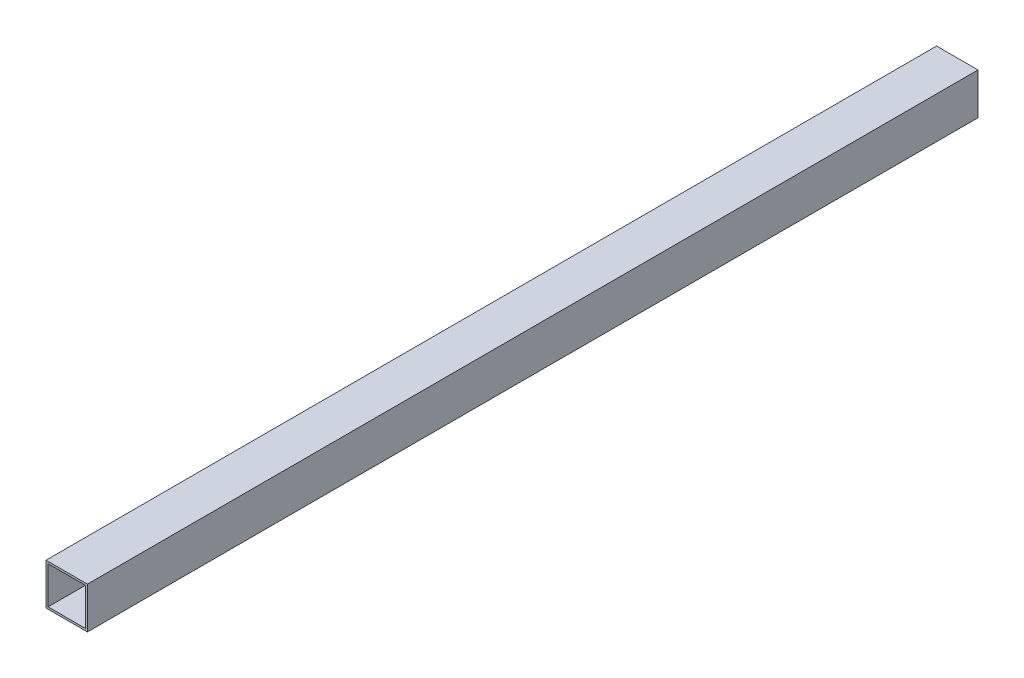
ISO-10303-21;
HEADER;
FILE_DESCRIPTION(('STEP AP214'),'2;1');
FILE_NAME('part.step','',(''),(''),'','','');
FILE_SCHEMA(('AUTOMOTIVE_DESIGN { 1 0 10303 214 1 1 1 1 }'));
ENDSEC;
DATA;
#1=APPLICATION_CONTEXT('core data for automotive mechanical design processes');
#2=APPLICATION_PROTOCOL_DEFINITION('international standard','automotive_design',2000,#1);
#3=PRODUCT_CONTEXT('',#1,'mechanical');
#4=PRODUCT('Part','Part','',(#3));
#5=PRODUCT_RELATED_PRODUCT_CATEGORY('part','',(#4));
#6=PRODUCT_DEFINITION_FORMATION('','',#4);
#7=PRODUCT_DEFINITION_CONTEXT('part definition',#1,'design');
#8=PRODUCT_DEFINITION('design','',#6,#7);
#9=PRODUCT_DEFINITION_SHAPE('','',#8);
#10=(LENGTH_UNIT() NAMED_UNIT(*) SI_UNIT(.MILLI.,.METRE.));
#11=(NAMED_UNIT(*) PLANE_ANGLE_UNIT() SI_UNIT($,.RADIAN.));
#12=(NAMED_UNIT(*) SI_UNIT($,.STERADIAN.) SOLID_ANGLE_UNIT());
#13=UNCERTAINTY_MEASURE_WITH_UNIT(LENGTH_MEASURE(1.E-05),#10,'distance_accuracy_value','');
#14=(GEOMETRIC_REPRESENTATION_CONTEXT(3) GLOBAL_UNCERTAINTY_ASSIGNED_CONTEXT((#13)) GLOBAL_UNIT_ASSIGNED_CONTEXT((#10,
#11,#12)) REPRESENTATION_CONTEXT('',''));
#15=CARTESIAN_POINT('',(0.,0.,0.));
#16=DIRECTION('',(0.,0.,1.));
#17=DIRECTION('',(1.,0.,0.));
#18=AXIS2_PLACEMENT_3D('',#15,#16,#17);
#19=CARTESIAN_POINT('',(0.,0.,430.));
#20=DIRECTION('',(0.,0.,1.));
#21=DIRECTION('',(1.,0.,0.));
#22=AXIS2_PLACEMENT_3D('',#19,#20,#21);
#23=PLANE('',#22);
#24=DIRECTION('',(0.,-1.,0.));
#25=VECTOR('',#24,1.);
#26=CARTESIAN_POINT('',(0.,0.,430.));
#27=LINE('',#26,#25);
#28=CARTESIAN_POINT('',(0.,0.,430.));
#29=VERTEX_POINT('',#28);
#30=CARTESIAN_POINT('',(0.,-20.,430.));
#31=VERTEX_POINT('',#30);
#32=EDGE_CURVE('E134',#29,#31,#27,.T.);
#33=ORIENTED_EDGE('',*,*,#32,.T.);
#34=DIRECTION('',(1.,0.,0.));
#35=VECTOR('',#34,1.);
#36=CARTESIAN_POINT('',(0.,-20.,430.));
#37=LINE('',#36,#35);
#38=CARTESIAN_POINT('',(20.,-20.,430.));
#39=VERTEX_POINT('',#38);
#40=EDGE_CURVE('E137',#31,#39,#37,.T.);
#41=ORIENTED_EDGE('',*,*,#40,.T.);
#42=DIRECTION('',(0.,1.,0.));
#43=VECTOR('',#42,1.);
#44=CARTESIAN_POINT('',(20.,0.,430.));
#45=LINE('',#44,#43);
#46=CARTESIAN_POINT('',(20.,0.,430.));
#47=VERTEX_POINT('',#46);
#48=EDGE_CURVE('E140',#39,#47,#45,.T.);
#49=ORIENTED_EDGE('',*,*,#48,.T.);
#50=DIRECTION('',(-1.,0.,0.));
#51=VECTOR('',#50,1.);
#52=CARTESIAN_POINT('',(0.,0.,430.));
#53=LINE('',#52,#51);
#54=EDGE_CURVE('E142',#47,#29,#53,.T.);
#55=ORIENTED_EDGE('',*,*,#54,.T.);
#56=EDGE_LOOP('',(#33,#41,#49,#55));
#57=FACE_BOUND('',#56,.T.);
#58=DIRECTION('',(-1.,0.,0.));
#59=VECTOR('',#58,1.);
#60=CARTESIAN_POINT('',(1.,-1.,430.));
#61=LINE('',#60,#59);
#62=CARTESIAN_POINT('',(19.,-1.,430.));
#63=VERTEX_POINT('',#62);
#64=CARTESIAN_POINT('',(1.,-1.,430.));
#65=VERTEX_POINT('',#64);
#66=EDGE_CURVE('E106',#63,#65,#61,.T.);
#67=ORIENTED_EDGE('',*,*,#66,.F.);
#68=DIRECTION('',(0.,1.,0.));
#69=VECTOR('',#68,1.);
#70=CARTESIAN_POINT('',(19.,-19.,430.));
#71=LINE('',#70,#69);
#72=CARTESIAN_POINT('',(19.,-19.,430.));
#73=VERTEX_POINT('',#72);
#74=EDGE_CURVE('E98',#73,#63,#71,.T.);
#75=ORIENTED_EDGE('',*,*,#74,.F.);
#76=DIRECTION('',(1.,0.,0.));
#77=VECTOR('',#76,1.);
#78=CARTESIAN_POINT('',(1.,-19.,430.));
#79=LINE('',#78,#77);
#80=CARTESIAN_POINT('',(1.,-19.,430.));
#81=VERTEX_POINT('',#80);
#82=EDGE_CURVE('E120',#81,#73,#79,.T.);
#83=ORIENTED_EDGE('',*,*,#82,.F.);
#84=DIRECTION('',(0.,-1.,0.));
#85=VECTOR('',#84,1.);
#86=CARTESIAN_POINT('',(1.,-19.,430.));
#87=LINE('',#86,#85);
#88=EDGE_CURVE('E118',#65,#81,#87,.T.);
#89=ORIENTED_EDGE('',*,*,#88,.F.);
#90=EDGE_LOOP('',(#67,#75,#83,#89));
#91=FACE_BOUND('',#90,.T.);
#92=ADVANCED_FACE('F33',(#57,#91),#23,.T.);
#93=CARTESIAN_POINT('',(0.,0.,0.));
#94=DIRECTION('',(0.,0.,1.));
#95=DIRECTION('',(1.,0.,0.));
#96=AXIS2_PLACEMENT_3D('',#93,#94,#95);
#97=PLANE('',#96);
#98=DIRECTION('',(0.,-1.,0.));
#99=VECTOR('',#98,1.);
#100=CARTESIAN_POINT('',(0.,0.,0.));
#101=LINE('',#100,#99);
#102=CARTESIAN_POINT('',(0.,0.,0.));
#103=VERTEX_POINT('',#102);
#104=CARTESIAN_POINT('',(0.,-20.,0.));
#105=VERTEX_POINT('',#104);
#106=EDGE_CURVE('E114',#103,#105,#101,.T.);
#107=ORIENTED_EDGE('',*,*,#106,.F.);
#108=DIRECTION('',(-1.,0.,0.));
#109=VECTOR('',#108,1.);
#110=CARTESIAN_POINT('',(0.,0.,0.));
#111=LINE('',#110,#109);
#112=CARTESIAN_POINT('',(20.,0.,0.));
#113=VERTEX_POINT('',#112);
#114=EDGE_CURVE('E138',#113,#103,#111,.T.);
#115=ORIENTED_EDGE('',*,*,#114,.F.);
#116=DIRECTION('',(0.,1.,0.));
#117=VECTOR('',#116,1.);
#118=CARTESIAN_POINT('',(20.,0.,0.));
#119=LINE('',#118,#117);
#120=CARTESIAN_POINT('',(20.,-20.,0.));
#121=VERTEX_POINT('',#120);
#122=EDGE_CURVE('E149',#121,#113,#119,.T.);
#123=ORIENTED_EDGE('',*,*,#122,.F.);
#124=DIRECTION('',(1.,0.,0.));
#125=VECTOR('',#124,1.);
#126=CARTESIAN_POINT('',(0.,-20.,0.));
#127=LINE('',#126,#125);
#128=EDGE_CURVE('E147',#105,#121,#127,.T.);
#129=ORIENTED_EDGE('',*,*,#128,.F.);
#130=EDGE_LOOP('',(#107,#115,#123,#129));
#131=FACE_BOUND('',#130,.T.);
#132=DIRECTION('',(0.,1.,0.));
#133=VECTOR('',#132,1.);
#134=CARTESIAN_POINT('',(19.,-19.,0.));
#135=LINE('',#134,#133);
#136=CARTESIAN_POINT('',(19.,-19.,0.));
#137=VERTEX_POINT('',#136);
#138=CARTESIAN_POINT('',(19.,-1.,0.));
#139=VERTEX_POINT('',#138);
#140=EDGE_CURVE('E56',#137,#139,#135,.T.);
#141=ORIENTED_EDGE('',*,*,#140,.T.);
#142=DIRECTION('',(-1.,0.,0.));
#143=VECTOR('',#142,1.);
#144=CARTESIAN_POINT('',(1.,-1.,0.));
#145=LINE('',#144,#143);
#146=CARTESIAN_POINT('',(1.,-1.,0.));
#147=VERTEX_POINT('',#146);
#148=EDGE_CURVE('E113',#139,#147,#145,.T.);
#149=ORIENTED_EDGE('',*,*,#148,.T.);
#150=DIRECTION('',(0.,-1.,0.));
#151=VECTOR('',#150,1.);
#152=CARTESIAN_POINT('',(1.,-19.,0.));
#153=LINE('',#152,#151);
#154=CARTESIAN_POINT('',(1.,-19.,0.));
#155=VERTEX_POINT('',#154);
#156=EDGE_CURVE('E126',#147,#155,#153,.T.);
#157=ORIENTED_EDGE('',*,*,#156,.T.);
#158=DIRECTION('',(1.,0.,0.));
#159=VECTOR('',#158,1.);
#160=CARTESIAN_POINT('',(1.,-19.,0.));
#161=LINE('',#160,#159);
#162=EDGE_CURVE('E107',#155,#137,#161,.T.);
#163=ORIENTED_EDGE('',*,*,#162,.T.);
#164=EDGE_LOOP('',(#141,#149,#157,#163));
#165=FACE_BOUND('',#164,.T.);
#166=ADVANCED_FACE('F167',(#131,#165),#97,.F.);
#167=CARTESIAN_POINT('',(0.,0.,430.));
#168=DIRECTION('',(1.,0.,0.));
#169=DIRECTION('',(0.,0.,-1.));
#170=AXIS2_PLACEMENT_3D('',#167,#168,#169);
#171=PLANE('',#170);
#172=ORIENTED_EDGE('',*,*,#106,.T.);
#173=DIRECTION('',(0.,0.,-1.));
#174=VECTOR('',#173,1.);
#175=CARTESIAN_POINT('',(0.,-20.,430.));
#176=LINE('',#175,#174);
#177=EDGE_CURVE('E11',#31,#105,#176,.T.);
#178=ORIENTED_EDGE('',*,*,#177,.F.);
#179=ORIENTED_EDGE('',*,*,#32,.F.);
#180=DIRECTION('',(0.,0.,-1.));
#181=VECTOR('',#180,1.);
#182=CARTESIAN_POINT('',(0.,0.,430.));
#183=LINE('',#182,#181);
#184=EDGE_CURVE('E144',#29,#103,#183,.T.);
#185=ORIENTED_EDGE('',*,*,#184,.T.);
#186=EDGE_LOOP('',(#172,#178,#179,#185));
#187=FACE_BOUND('',#186,.T.);
#188=ADVANCED_FACE('F35',(#187),#171,.F.);
#189=CARTESIAN_POINT('',(0.,-20.,430.));
#190=DIRECTION('',(0.,1.,0.));
#191=DIRECTION('',(0.,0.,1.));
#192=AXIS2_PLACEMENT_3D('',#189,#190,#191);
#193=PLANE('',#192);
#194=ORIENTED_EDGE('',*,*,#128,.T.);
#195=DIRECTION('',(0.,0.,-1.));
#196=VECTOR('',#195,1.);
#197=CARTESIAN_POINT('',(20.,-20.,430.));
#198=LINE('',#197,#196);
#199=EDGE_CURVE('E41',#39,#121,#198,.T.);
#200=ORIENTED_EDGE('',*,*,#199,.F.);
#201=ORIENTED_EDGE('',*,*,#40,.F.);
#202=ORIENTED_EDGE('',*,*,#177,.T.);
#203=EDGE_LOOP('',(#194,#200,#201,#202));
#204=FACE_BOUND('',#203,.T.);
#205=ADVANCED_FACE('F177',(#204),#193,.F.);
#206=CARTESIAN_POINT('',(20.,0.,430.));
#207=DIRECTION('',(-1.,0.,0.));
#208=DIRECTION('',(0.,-1.,0.));
#209=AXIS2_PLACEMENT_3D('',#206,#207,#208);
#210=PLANE('',#209);
#211=ORIENTED_EDGE('',*,*,#122,.T.);
#212=DIRECTION('',(0.,0.,-1.));
#213=VECTOR('',#212,1.);
#214=CARTESIAN_POINT('',(20.,0.,430.));
#215=LINE('',#214,#213);
#216=EDGE_CURVE('E154',#47,#113,#215,.T.);
#217=ORIENTED_EDGE('',*,*,#216,.F.);
#218=ORIENTED_EDGE('',*,*,#48,.F.);
#219=ORIENTED_EDGE('',*,*,#199,.T.);
#220=EDGE_LOOP('',(#211,#217,#218,#219));
#221=FACE_BOUND('',#220,.T.);
#222=ADVANCED_FACE('F161',(#221),#210,.F.);
#223=CARTESIAN_POINT('',(0.,0.,430.));
#224=DIRECTION('',(0.,-1.,0.));
#225=DIRECTION('',(0.,0.,-1.));
#226=AXIS2_PLACEMENT_3D('',#223,#224,#225);
#227=PLANE('',#226);
#228=ORIENTED_EDGE('',*,*,#114,.T.);
#229=ORIENTED_EDGE('',*,*,#184,.F.);
#230=ORIENTED_EDGE('',*,*,#54,.F.);
#231=ORIENTED_EDGE('',*,*,#216,.T.);
#232=EDGE_LOOP('',(#228,#229,#230,#231));
#233=FACE_BOUND('',#232,.T.);
#234=ADVANCED_FACE('F171',(#233),#227,.F.);
#235=CARTESIAN_POINT('',(19.,-19.,430.));
#236=DIRECTION('',(-1.,0.,0.));
#237=DIRECTION('',(0.,0.,1.));
#238=AXIS2_PLACEMENT_3D('',#235,#236,#237);
#239=PLANE('',#238);
#240=ORIENTED_EDGE('',*,*,#140,.F.);
#241=DIRECTION('',(0.,0.,-1.));
#242=VECTOR('',#241,1.);
#243=CARTESIAN_POINT('',(19.,-19.,430.));
#244=LINE('',#243,#242);
#245=EDGE_CURVE('E102',#73,#137,#244,.T.);
#246=ORIENTED_EDGE('',*,*,#245,.F.);
#247=ORIENTED_EDGE('',*,*,#74,.T.);
#248=DIRECTION('',(0.,0.,-1.));
#249=VECTOR('',#248,1.);
#250=CARTESIAN_POINT('',(19.,-1.,430.));
#251=LINE('',#250,#249);
#252=EDGE_CURVE('E101',#63,#139,#251,.T.);
#253=ORIENTED_EDGE('',*,*,#252,.T.);
#254=EDGE_LOOP('',(#240,#246,#247,#253));
#255=FACE_BOUND('',#254,.T.);
#256=ADVANCED_FACE('F100',(#255),#239,.T.);
#257=CARTESIAN_POINT('',(1.,-1.,430.));
#258=DIRECTION('',(0.,-1.,0.));
#259=DIRECTION('',(0.,0.,-1.));
#260=AXIS2_PLACEMENT_3D('',#257,#258,#259);
#261=PLANE('',#260);
#262=ORIENTED_EDGE('',*,*,#148,.F.);
#263=ORIENTED_EDGE('',*,*,#252,.F.);
#264=ORIENTED_EDGE('',*,*,#66,.T.);
#265=DIRECTION('',(0.,0.,-1.));
#266=VECTOR('',#265,1.);
#267=CARTESIAN_POINT('',(1.,-1.,430.));
#268=LINE('',#267,#266);
#269=EDGE_CURVE('E115',#65,#147,#268,.T.);
#270=ORIENTED_EDGE('',*,*,#269,.T.);
#271=EDGE_LOOP('',(#262,#263,#264,#270));
#272=FACE_BOUND('',#271,.T.);
#273=ADVANCED_FACE('F110',(#272),#261,.T.);
#274=CARTESIAN_POINT('',(1.,-19.,430.));
#275=DIRECTION('',(1.,0.,0.));
#276=DIRECTION('',(0.,0.,-1.));
#277=AXIS2_PLACEMENT_3D('',#274,#275,#276);
#278=PLANE('',#277);
#279=ORIENTED_EDGE('',*,*,#156,.F.);
#280=ORIENTED_EDGE('',*,*,#269,.F.);
#281=ORIENTED_EDGE('',*,*,#88,.T.);
#282=DIRECTION('',(0.,0.,-1.));
#283=VECTOR('',#282,1.);
#284=CARTESIAN_POINT('',(1.,-19.,430.));
#285=LINE('',#284,#283);
#286=EDGE_CURVE('E48',#81,#155,#285,.T.);
#287=ORIENTED_EDGE('',*,*,#286,.T.);
#288=EDGE_LOOP('',(#279,#280,#281,#287));
#289=FACE_BOUND('',#288,.T.);
#290=ADVANCED_FACE('F200',(#289),#278,.T.);
#291=CARTESIAN_POINT('',(1.,-19.,430.));
#292=DIRECTION('',(0.,1.,0.));
#293=DIRECTION('',(0.,0.,1.));
#294=AXIS2_PLACEMENT_3D('',#291,#292,#293);
#295=PLANE('',#294);
#296=ORIENTED_EDGE('',*,*,#162,.F.);
#297=ORIENTED_EDGE('',*,*,#286,.F.);
#298=ORIENTED_EDGE('',*,*,#82,.T.);
#299=ORIENTED_EDGE('',*,*,#245,.T.);
#300=EDGE_LOOP('',(#296,#297,#298,#299));
#301=FACE_BOUND('',#300,.T.);
#302=ADVANCED_FACE('F204',(#301),#295,.T.);
#303=CLOSED_SHELL('',(#92,#166,#188,#205,#222,#234,#256,#273,#290,#302));
#304=MANIFOLD_SOLID_BREP('B2',#303);
#305=ADVANCED_BREP_SHAPE_REPRESENTATION('',(#18,#304),#14);
#306=SHAPE_DEFINITION_REPRESENTATION(#9,#305);
ENDSEC;
END-ISO-10303-21;
